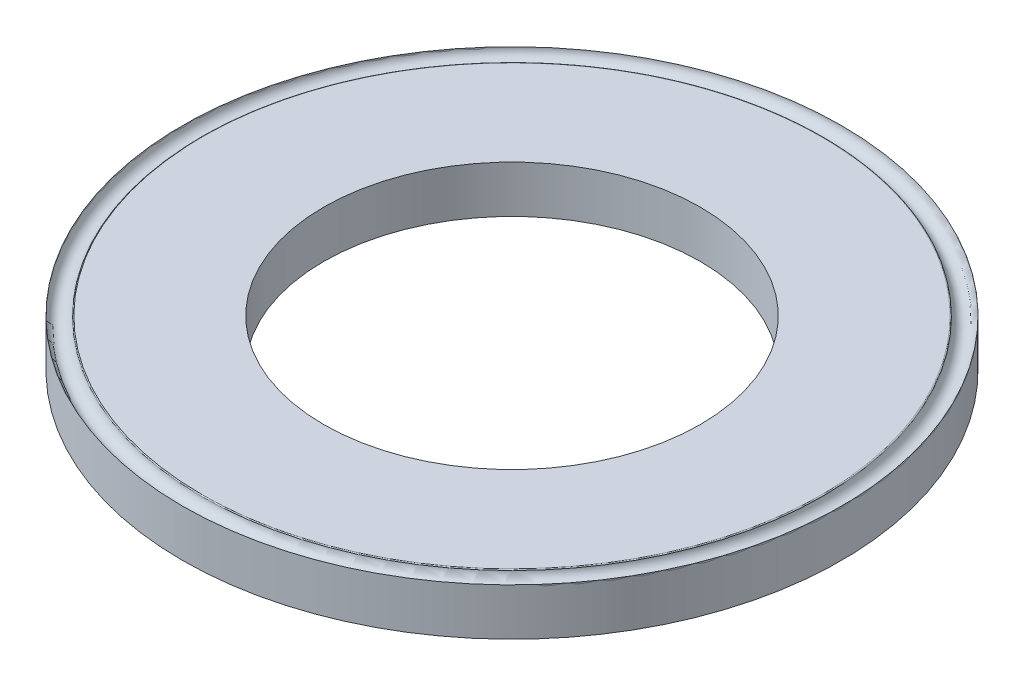
ISO-10303-21;
HEADER;
FILE_DESCRIPTION(('STEP AP214'),'2;1');
FILE_NAME('part.step','',(''),(''),'','','');
FILE_SCHEMA(('AUTOMOTIVE_DESIGN { 1 0 10303 214 1 1 1 1 }'));
ENDSEC;
DATA;
#1=APPLICATION_CONTEXT('core data for automotive mechanical design processes');
#2=APPLICATION_PROTOCOL_DEFINITION('international standard','automotive_design',2000,#1);
#3=PRODUCT_CONTEXT('',#1,'mechanical');
#4=PRODUCT('Part','Part','',(#3));
#5=PRODUCT_RELATED_PRODUCT_CATEGORY('part','',(#4));
#6=PRODUCT_DEFINITION_FORMATION('','',#4);
#7=PRODUCT_DEFINITION_CONTEXT('part definition',#1,'design');
#8=PRODUCT_DEFINITION('design','',#6,#7);
#9=PRODUCT_DEFINITION_SHAPE('','',#8);
#10=(LENGTH_UNIT() NAMED_UNIT(*) SI_UNIT(.MILLI.,.METRE.));
#11=(NAMED_UNIT(*) PLANE_ANGLE_UNIT() SI_UNIT($,.RADIAN.));
#12=(NAMED_UNIT(*) SI_UNIT($,.STERADIAN.) SOLID_ANGLE_UNIT());
#13=UNCERTAINTY_MEASURE_WITH_UNIT(LENGTH_MEASURE(1.E-05),#10,'distance_accuracy_value','');
#14=(GEOMETRIC_REPRESENTATION_CONTEXT(3) GLOBAL_UNCERTAINTY_ASSIGNED_CONTEXT((#13)) GLOBAL_UNIT_ASSIGNED_CONTEXT((#10,
#11,#12)) REPRESENTATION_CONTEXT('',''));
#15=CARTESIAN_POINT('',(0.,0.,0.));
#16=DIRECTION('',(0.,0.,1.));
#17=DIRECTION('',(1.,0.,0.));
#18=AXIS2_PLACEMENT_3D('',#15,#16,#17);
#19=CARTESIAN_POINT('',(0.,0.25,0.));
#20=DIRECTION('',(0.,1.,0.));
#21=DIRECTION('',(0.,0.,1.));
#22=AXIS2_PLACEMENT_3D('',#19,#20,#21);
#23=PLANE('',#22);
#24=CARTESIAN_POINT('',(0.,0.25,0.));
#25=DIRECTION('',(0.,1.,0.));
#26=DIRECTION('',(0.,0.,1.));
#27=AXIS2_PLACEMENT_3D('',#24,#25,#26);
#28=CIRCLE('',#27,3.29045548849897);
#29=CARTESIAN_POINT('',(0.,0.25,3.29045548849897));
#30=VERTEX_POINT('',#29);
#31=EDGE_CURVE('E65',#30,#30,#28,.T.);
#32=ORIENTED_EDGE('',*,*,#31,.T.);
#33=EDGE_LOOP('',(#32));
#34=FACE_BOUND('',#33,.T.);
#35=CARTESIAN_POINT('',(0.,0.25,0.));
#36=DIRECTION('',(0.,1.,0.));
#37=DIRECTION('',(0.,0.,1.));
#38=AXIS2_PLACEMENT_3D('',#35,#36,#37);
#39=CIRCLE('',#38,2.);
#40=CARTESIAN_POINT('',(0.,0.25,2.));
#41=VERTEX_POINT('',#40);
#42=EDGE_CURVE('E44',#41,#41,#39,.T.);
#43=ORIENTED_EDGE('',*,*,#42,.F.);
#44=EDGE_LOOP('',(#43));
#45=FACE_BOUND('',#44,.T.);
#46=ADVANCED_FACE('F36',(#34,#45),#23,.T.);
#47=CARTESIAN_POINT('',(0.,-0.25,0.));
#48=DIRECTION('',(0.,1.,0.));
#49=DIRECTION('',(0.,0.,1.));
#50=AXIS2_PLACEMENT_3D('',#47,#48,#49);
#51=PLANE('',#50);
#52=CARTESIAN_POINT('',(0.,-0.25,0.));
#53=DIRECTION('',(0.,1.,0.));
#54=DIRECTION('',(0.,0.,1.));
#55=AXIS2_PLACEMENT_3D('',#52,#53,#54);
#56=CIRCLE('',#55,3.5);
#57=CARTESIAN_POINT('',(0.,-0.25,3.5));
#58=VERTEX_POINT('',#57);
#59=EDGE_CURVE('E10',#58,#58,#56,.T.);
#60=ORIENTED_EDGE('',*,*,#59,.F.);
#61=EDGE_LOOP('',(#60));
#62=FACE_BOUND('',#61,.T.);
#63=CARTESIAN_POINT('',(0.,-0.25,0.));
#64=DIRECTION('',(0.,1.,0.));
#65=DIRECTION('',(0.,0.,1.));
#66=AXIS2_PLACEMENT_3D('',#63,#64,#65);
#67=CIRCLE('',#66,2.);
#68=CARTESIAN_POINT('',(0.,-0.25,2.));
#69=VERTEX_POINT('',#68);
#70=EDGE_CURVE('E50',#69,#69,#67,.T.);
#71=ORIENTED_EDGE('',*,*,#70,.T.);
#72=EDGE_LOOP('',(#71));
#73=FACE_BOUND('',#72,.T.);
#74=ADVANCED_FACE('F85',(#62,#73),#51,.F.);
#75=CARTESIAN_POINT('',(0.,0.25,0.));
#76=DIRECTION('',(0.,-1.,0.));
#77=DIRECTION('',(0.,0.,-1.));
#78=AXIS2_PLACEMENT_3D('',#75,#76,#77);
#79=CYLINDRICAL_SURFACE('',#78,3.5);
#80=CARTESIAN_POINT('',(0.,0.25,0.));
#81=DIRECTION('',(0.,1.,0.));
#82=DIRECTION('',(0.,0.,1.));
#83=AXIS2_PLACEMENT_3D('',#80,#81,#82);
#84=CIRCLE('',#83,3.5);
#85=CARTESIAN_POINT('',(0.,0.25,3.5));
#86=VERTEX_POINT('',#85);
#87=EDGE_CURVE('E61',#86,#86,#84,.T.);
#88=ORIENTED_EDGE('',*,*,#87,.F.);
#89=EDGE_LOOP('',(#88));
#90=FACE_BOUND('',#89,.T.);
#91=ORIENTED_EDGE('',*,*,#59,.T.);
#92=EDGE_LOOP('',(#91));
#93=FACE_BOUND('',#92,.T.);
#94=ADVANCED_FACE('F38',(#90,#93),#79,.T.);
#95=CARTESIAN_POINT('',(0.,0.25,0.));
#96=DIRECTION('',(0.,-1.,0.));
#97=DIRECTION('',(0.,0.,-1.));
#98=AXIS2_PLACEMENT_3D('',#95,#96,#97);
#99=CYLINDRICAL_SURFACE('',#98,2.);
#100=ORIENTED_EDGE('',*,*,#42,.T.);
#101=EDGE_LOOP('',(#100));
#102=FACE_BOUND('',#101,.T.);
#103=ORIENTED_EDGE('',*,*,#70,.F.);
#104=EDGE_LOOP('',(#103));
#105=FACE_BOUND('',#104,.T.);
#106=ADVANCED_FACE('F75',(#102,#105),#99,.F.);
#107=CARTESIAN_POINT('',(0.,0.24,0.));
#108=DIRECTION('',(0.,1.,0.));
#109=DIRECTION('',(0.,0.,1.));
#110=AXIS2_PLACEMENT_3D('',#107,#108,#109);
#111=TOROIDAL_SURFACE('',#110,3.29045548849897,0.01);
#112=ORIENTED_EDGE('',*,*,#31,.F.);
#113=EDGE_LOOP('',(#112));
#114=FACE_BOUND('',#113,.T.);
#115=CARTESIAN_POINT('',(0.,0.240909090909091,0.));
#116=DIRECTION('',(0.,1.,0.));
#117=DIRECTION('',(0.,0.,1.));
#118=AXIS2_PLACEMENT_3D('',#115,#116,#117);
#119=CIRCLE('',#118,3.30041408045361);
#120=CARTESIAN_POINT('',(0.,0.240909090909091,3.30041408045361));
#121=VERTEX_POINT('',#120);
#122=EDGE_CURVE('E56',#121,#121,#119,.T.);
#123=ORIENTED_EDGE('',*,*,#122,.T.);
#124=EDGE_LOOP('',(#123));
#125=FACE_BOUND('',#124,.T.);
#126=ADVANCED_FACE('F71',(#114,#125),#111,.T.);
#127=CARTESIAN_POINT('',(0.,0.25,0.));
#128=DIRECTION('',(0.,1.,0.));
#129=DIRECTION('',(0.,0.,1.));
#130=AXIS2_PLACEMENT_3D('',#127,#128,#129);
#131=TOROIDAL_SURFACE('',#130,3.4,0.0999999999999996);
#132=ORIENTED_EDGE('',*,*,#122,.F.);
#133=EDGE_LOOP('',(#132));
#134=FACE_BOUND('',#133,.T.);
#135=ORIENTED_EDGE('',*,*,#87,.T.);
#136=EDGE_LOOP('',(#135));
#137=FACE_BOUND('',#136,.T.);
#138=ADVANCED_FACE('F74',(#134,#137),#131,.F.);
#139=CLOSED_SHELL('',(#46,#74,#94,#106,#126,#138));
#140=MANIFOLD_SOLID_BREP('B2',#139);
#141=ADVANCED_BREP_SHAPE_REPRESENTATION('',(#18,#140),#14);
#142=SHAPE_DEFINITION_REPRESENTATION(#9,#141);
ENDSEC;
END-ISO-10303-21;
